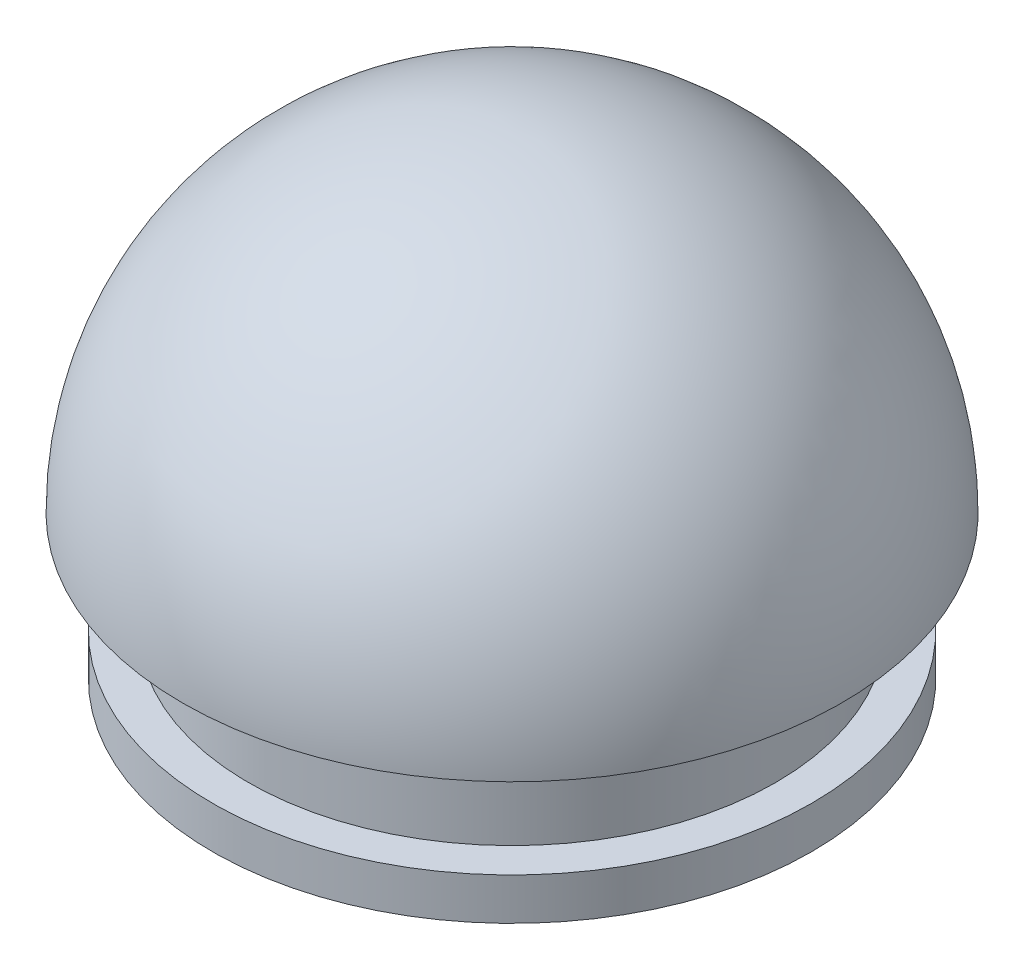
ISO-10303-21;
HEADER;
FILE_DESCRIPTION(('STEP AP214'),'2;1');
FILE_NAME('part.step','',(''),(''),'','','');
FILE_SCHEMA(('AUTOMOTIVE_DESIGN { 1 0 10303 214 1 1 1 1 }'));
ENDSEC;
DATA;
#1=APPLICATION_CONTEXT('core data for automotive mechanical design processes');
#2=APPLICATION_PROTOCOL_DEFINITION('international standard','automotive_design',2000,#1);
#3=PRODUCT_CONTEXT('',#1,'mechanical');
#4=PRODUCT('Part','Part','',(#3));
#5=PRODUCT_RELATED_PRODUCT_CATEGORY('part','',(#4));
#6=PRODUCT_DEFINITION_FORMATION('','',#4);
#7=PRODUCT_DEFINITION_CONTEXT('part definition',#1,'design');
#8=PRODUCT_DEFINITION('design','',#6,#7);
#9=PRODUCT_DEFINITION_SHAPE('','',#8);
#10=(LENGTH_UNIT() NAMED_UNIT(*) SI_UNIT(.MILLI.,.METRE.));
#11=(NAMED_UNIT(*) PLANE_ANGLE_UNIT() SI_UNIT($,.RADIAN.));
#12=(NAMED_UNIT(*) SI_UNIT($,.STERADIAN.) SOLID_ANGLE_UNIT());
#13=UNCERTAINTY_MEASURE_WITH_UNIT(LENGTH_MEASURE(1.E-05),#10,'distance_accuracy_value','');
#14=(GEOMETRIC_REPRESENTATION_CONTEXT(3) GLOBAL_UNCERTAINTY_ASSIGNED_CONTEXT((#13)) GLOBAL_UNIT_ASSIGNED_CONTEXT((#10,
#11,#12)) REPRESENTATION_CONTEXT('',''));
#15=CARTESIAN_POINT('',(0.,0.,0.));
#16=DIRECTION('',(0.,0.,1.));
#17=DIRECTION('',(1.,0.,0.));
#18=AXIS2_PLACEMENT_3D('',#15,#16,#17);
#19=CARTESIAN_POINT('',(0.,0.,0.));
#20=DIRECTION('',(0.,0.,1.));
#21=DIRECTION('',(-1.,0.,0.));
#22=AXIS2_PLACEMENT_3D('',#19,#20,#21);
#23=SPHERICAL_SURFACE('',#22,25.);
#24=CARTESIAN_POINT('',(0.,0.,0.));
#25=DIRECTION('',(0.,-1.,0.));
#26=DIRECTION('',(1.,0.,0.));
#27=AXIS2_PLACEMENT_3D('',#24,#25,#26);
#28=SPHERICAL_SURFACE('',#27,25.);
#29=CARTESIAN_POINT('',(0.,5.,0.));
#30=DIRECTION('',(0.,-1.,0.));
#31=DIRECTION('',(1.,0.,0.));
#32=AXIS2_PLACEMENT_3D('',#29,#30,#31);
#33=CIRCLE('',#32,24.4948974278318);
#34=CARTESIAN_POINT('',(24.4948974278318,5.00000000000017,0.));
#35=VERTEX_POINT('',#34);
#36=EDGE_CURVE('E42',#35,#35,#33,.T.);
#37=ORIENTED_EDGE('',*,*,#36,.T.);
#38=EDGE_LOOP('',(#37));
#39=FACE_BOUND('',#38,.T.);
#40=ADVANCED_FACE('F31',(#39),#28,.F.);
#41=CARTESIAN_POINT('',(0.,5.,0.));
#42=DIRECTION('',(0.,-1.,0.));
#43=DIRECTION('',(1.,0.,0.));
#44=AXIS2_PLACEMENT_3D('',#41,#42,#43);
#45=PLANE('',#44);
#46=CARTESIAN_POINT('',(0.,5.,0.));
#47=DIRECTION('',(0.,-1.,0.));
#48=DIRECTION('',(1.,0.,0.));
#49=AXIS2_PLACEMENT_3D('',#46,#47,#48);
#50=CIRCLE('',#49,19.5);
#51=CARTESIAN_POINT('',(19.5,5.00000000000014,0.));
#52=VERTEX_POINT('',#51);
#53=EDGE_CURVE('E55',#52,#52,#50,.T.);
#54=ORIENTED_EDGE('',*,*,#53,.T.);
#55=EDGE_LOOP('',(#54));
#56=FACE_BOUND('',#55,.T.);
#57=ORIENTED_EDGE('',*,*,#36,.F.);
#58=EDGE_LOOP('',(#57));
#59=FACE_BOUND('',#58,.T.);
#60=ADVANCED_FACE('F64',(#56,#59),#45,.F.);
#61=CARTESIAN_POINT('',(0.,5.,0.));
#62=DIRECTION('',(0.,-1.,0.));
#63=DIRECTION('',(1.,0.,0.));
#64=AXIS2_PLACEMENT_3D('',#61,#62,#63);
#65=CYLINDRICAL_SURFACE('',#64,19.5);
#66=ORIENTED_EDGE('',*,*,#53,.F.);
#67=EDGE_LOOP('',(#66));
#68=FACE_BOUND('',#67,.T.);
#69=CARTESIAN_POINT('',(0.,-12.,0.));
#70=DIRECTION('',(0.,-1.,0.));
#71=DIRECTION('',(1.,0.,0.));
#72=AXIS2_PLACEMENT_3D('',#69,#70,#71);
#73=CIRCLE('',#72,19.5);
#74=CARTESIAN_POINT('',(19.5000000000001,-11.9999999999999,0.));
#75=VERTEX_POINT('',#74);
#76=EDGE_CURVE('E58',#75,#75,#73,.T.);
#77=ORIENTED_EDGE('',*,*,#76,.T.);
#78=EDGE_LOOP('',(#77));
#79=FACE_BOUND('',#78,.T.);
#80=ADVANCED_FACE('F67',(#68,#79),#65,.F.);
#81=CARTESIAN_POINT('',(0.,-12.,0.));
#82=DIRECTION('',(0.,1.,0.));
#83=DIRECTION('',(-1.,0.,0.));
#84=AXIS2_PLACEMENT_3D('',#81,#82,#83);
#85=CYLINDRICAL_SURFACE('',#84,22.);
#86=CARTESIAN_POINT('',(0.,0.,0.));
#87=DIRECTION('',(0.,-1.,0.));
#88=DIRECTION('',(1.,0.,0.));
#89=AXIS2_PLACEMENT_3D('',#86,#87,#88);
#90=CIRCLE('',#89,22.);
#91=CARTESIAN_POINT('',(22.,1.5352432260285E-13,0.));
#92=VERTEX_POINT('',#91);
#93=EDGE_CURVE('E47',#92,#92,#90,.T.);
#94=ORIENTED_EDGE('',*,*,#93,.T.);
#95=EDGE_LOOP('',(#94));
#96=FACE_BOUND('',#95,.T.);
#97=CARTESIAN_POINT('',(0.,-8.5,0.));
#98=DIRECTION('',(0.,-1.,0.));
#99=DIRECTION('',(1.,0.,0.));
#100=AXIS2_PLACEMENT_3D('',#97,#98,#99);
#101=CIRCLE('',#100,22.);
#102=CARTESIAN_POINT('',(22.0000000000001,-8.49999999999985,0.));
#103=VERTEX_POINT('',#102);
#104=EDGE_CURVE('E10',#103,#103,#101,.T.);
#105=ORIENTED_EDGE('',*,*,#104,.F.);
#106=EDGE_LOOP('',(#105));
#107=FACE_BOUND('',#106,.T.);
#108=ADVANCED_FACE('F70',(#96,#107),#85,.T.);
#109=CARTESIAN_POINT('',(0.,0.,0.));
#110=DIRECTION('',(-0.0362296413665244,0.,-0.99934349104122));
#111=DIRECTION('',(0.99934349104122,0.,-0.0362296413665244));
#112=AXIS2_PLACEMENT_3D('',#109,#110,#111);
#113=SPHERICAL_SURFACE('',#112,27.5);
#114=CARTESIAN_POINT('',(0.,0.,0.));
#115=DIRECTION('',(0.,-1.,0.));
#116=DIRECTION('',(0.0724117125647878,0.,0.997374826172906));
#117=AXIS2_PLACEMENT_3D('',#114,#115,#116);
#118=SPHERICAL_SURFACE('',#117,27.5);
#119=CARTESIAN_POINT('',(0.,0.,0.));
#120=DIRECTION('',(0.,-1.,0.));
#121=DIRECTION('',(0.0724117125647878,0.,0.997374826172906));
#122=AXIS2_PLACEMENT_3D('',#119,#120,#121);
#123=CIRCLE('',#122,27.5);
#124=CARTESIAN_POINT('',(1.99132209553166,0.,27.4278077197549));
#125=VERTEX_POINT('',#124);
#126=EDGE_CURVE('E38',#125,#125,#123,.T.);
#127=ORIENTED_EDGE('',*,*,#126,.F.);
#128=EDGE_LOOP('',(#127));
#129=FACE_BOUND('',#128,.T.);
#130=ADVANCED_FACE('F33',(#129),#118,.T.);
#131=CARTESIAN_POINT('',(0.,0.,0.));
#132=DIRECTION('',(0.,-1.,0.));
#133=DIRECTION('',(0.0724117125647878,0.,0.997374826172906));
#134=AXIS2_PLACEMENT_3D('',#131,#132,#133);
#135=PLANE('',#134);
#136=ORIENTED_EDGE('',*,*,#93,.F.);
#137=EDGE_LOOP('',(#136));
#138=FACE_BOUND('',#137,.T.);
#139=ORIENTED_EDGE('',*,*,#126,.T.);
#140=EDGE_LOOP('',(#139));
#141=FACE_BOUND('',#140,.T.);
#142=ADVANCED_FACE('F83',(#138,#141),#135,.T.);
#143=CARTESIAN_POINT('',(0.,-8.5,0.));
#144=DIRECTION('',(0.,-1.,0.));
#145=DIRECTION('',(1.,0.,0.));
#146=AXIS2_PLACEMENT_3D('',#143,#144,#145);
#147=CYLINDRICAL_SURFACE('',#146,25.);
#148=CARTESIAN_POINT('',(0.,-8.5,0.));
#149=DIRECTION('',(0.,-1.,0.));
#150=DIRECTION('',(1.,0.,0.));
#151=AXIS2_PLACEMENT_3D('',#148,#149,#150);
#152=CIRCLE('',#151,25.);
#153=CARTESIAN_POINT('',(25.0000000000001,-8.49999999999983,0.));
#154=VERTEX_POINT('',#153);
#155=EDGE_CURVE('E51',#154,#154,#152,.T.);
#156=ORIENTED_EDGE('',*,*,#155,.T.);
#157=EDGE_LOOP('',(#156));
#158=FACE_BOUND('',#157,.T.);
#159=CARTESIAN_POINT('',(0.,-12.,0.));
#160=DIRECTION('',(0.,-1.,0.));
#161=DIRECTION('',(1.,0.,0.));
#162=AXIS2_PLACEMENT_3D('',#159,#160,#161);
#163=CIRCLE('',#162,25.);
#164=CARTESIAN_POINT('',(25.0000000000001,-11.9999999999998,0.));
#165=VERTEX_POINT('',#164);
#166=EDGE_CURVE('E52',#165,#165,#163,.T.);
#167=ORIENTED_EDGE('',*,*,#166,.F.);
#168=EDGE_LOOP('',(#167));
#169=FACE_BOUND('',#168,.T.);
#170=ADVANCED_FACE('F81',(#158,#169),#147,.T.);
#171=CARTESIAN_POINT('',(0.,-8.5,0.));
#172=DIRECTION('',(0.,-1.,0.));
#173=DIRECTION('',(1.,0.,0.));
#174=AXIS2_PLACEMENT_3D('',#171,#172,#173);
#175=PLANE('',#174);
#176=ORIENTED_EDGE('',*,*,#104,.T.);
#177=EDGE_LOOP('',(#176));
#178=FACE_BOUND('',#177,.T.);
#179=ORIENTED_EDGE('',*,*,#155,.F.);
#180=EDGE_LOOP('',(#179));
#181=FACE_BOUND('',#180,.T.);
#182=ADVANCED_FACE('F77',(#178,#181),#175,.F.);
#183=CARTESIAN_POINT('',(0.,-12.,0.));
#184=DIRECTION('',(0.,-1.,0.));
#185=DIRECTION('',(1.,0.,0.));
#186=AXIS2_PLACEMENT_3D('',#183,#184,#185);
#187=PLANE('',#186);
#188=ORIENTED_EDGE('',*,*,#76,.F.);
#189=EDGE_LOOP('',(#188));
#190=FACE_BOUND('',#189,.T.);
#191=ORIENTED_EDGE('',*,*,#166,.T.);
#192=EDGE_LOOP('',(#191));
#193=FACE_BOUND('',#192,.T.);
#194=ADVANCED_FACE('F74',(#190,#193),#187,.T.);
#195=CLOSED_SHELL('',(#40,#60,#80,#108,#130,#142,#170,#182,#194));
#196=MANIFOLD_SOLID_BREP('B2',#195);
#197=ADVANCED_BREP_SHAPE_REPRESENTATION('',(#18,#196),#14);
#198=SHAPE_DEFINITION_REPRESENTATION(#9,#197);
ENDSEC;
END-ISO-10303-21;
